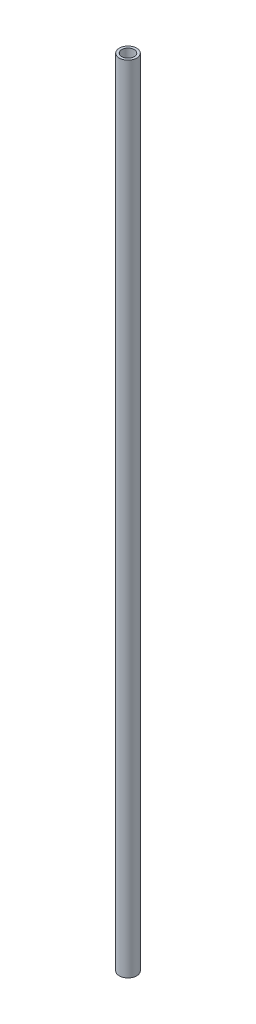
ISO-10303-21;
HEADER;
FILE_DESCRIPTION(('STEP AP214'),'2;1');
FILE_NAME('part.step','',(''),(''),'','','');
FILE_SCHEMA(('AUTOMOTIVE_DESIGN { 1 0 10303 214 1 1 1 1 }'));
ENDSEC;
DATA;
#1=APPLICATION_CONTEXT('core data for automotive mechanical design processes');
#2=APPLICATION_PROTOCOL_DEFINITION('international standard','automotive_design',2000,#1);
#3=PRODUCT_CONTEXT('',#1,'mechanical');
#4=PRODUCT('Part','Part','',(#3));
#5=PRODUCT_RELATED_PRODUCT_CATEGORY('part','',(#4));
#6=PRODUCT_DEFINITION_FORMATION('','',#4);
#7=PRODUCT_DEFINITION_CONTEXT('part definition',#1,'design');
#8=PRODUCT_DEFINITION('design','',#6,#7);
#9=PRODUCT_DEFINITION_SHAPE('','',#8);
#10=(LENGTH_UNIT() NAMED_UNIT(*) SI_UNIT(.MILLI.,.METRE.));
#11=(NAMED_UNIT(*) PLANE_ANGLE_UNIT() SI_UNIT($,.RADIAN.));
#12=(NAMED_UNIT(*) SI_UNIT($,.STERADIAN.) SOLID_ANGLE_UNIT());
#13=UNCERTAINTY_MEASURE_WITH_UNIT(LENGTH_MEASURE(1.E-05),#10,'distance_accuracy_value','');
#14=(GEOMETRIC_REPRESENTATION_CONTEXT(3) GLOBAL_UNCERTAINTY_ASSIGNED_CONTEXT((#13)) GLOBAL_UNIT_ASSIGNED_CONTEXT((#10,
#11,#12)) REPRESENTATION_CONTEXT('',''));
#15=CARTESIAN_POINT('',(0.,0.,0.));
#16=DIRECTION('',(0.,0.,1.));
#17=DIRECTION('',(1.,0.,0.));
#18=AXIS2_PLACEMENT_3D('',#15,#16,#17);
#19=CARTESIAN_POINT('',(0.,1219.2,0.));
#20=DIRECTION('',(0.,1.,0.));
#21=DIRECTION('',(0.,0.,1.));
#22=AXIS2_PLACEMENT_3D('',#19,#20,#21);
#23=PLANE('',#22);
#24=CARTESIAN_POINT('',(0.,1219.2,0.));
#25=DIRECTION('',(0.,1.,0.));
#26=DIRECTION('',(0.,0.,1.));
#27=AXIS2_PLACEMENT_3D('',#24,#25,#26);
#28=CIRCLE('',#27,13.335);
#29=CARTESIAN_POINT('',(0.,1219.2,13.335));
#30=VERTEX_POINT('',#29);
#31=EDGE_CURVE('E10',#30,#30,#28,.T.);
#32=ORIENTED_EDGE('',*,*,#31,.T.);
#33=EDGE_LOOP('',(#32));
#34=FACE_BOUND('',#33,.T.);
#35=CARTESIAN_POINT('',(0.,1219.2,0.));
#36=DIRECTION('',(0.,1.,0.));
#37=DIRECTION('',(0.,0.,1.));
#38=AXIS2_PLACEMENT_3D('',#35,#36,#37);
#39=CIRCLE('',#38,9.525);
#40=CARTESIAN_POINT('',(0.,1219.2,9.525));
#41=VERTEX_POINT('',#40);
#42=EDGE_CURVE('E45',#41,#41,#39,.T.);
#43=ORIENTED_EDGE('',*,*,#42,.F.);
#44=EDGE_LOOP('',(#43));
#45=FACE_BOUND('',#44,.T.);
#46=ADVANCED_FACE('F34',(#34,#45),#23,.T.);
#47=CARTESIAN_POINT('',(0.,0.,0.));
#48=DIRECTION('',(0.,1.,0.));
#49=DIRECTION('',(0.,0.,1.));
#50=AXIS2_PLACEMENT_3D('',#47,#48,#49);
#51=PLANE('',#50);
#52=CARTESIAN_POINT('',(0.,0.,0.));
#53=DIRECTION('',(0.,1.,0.));
#54=DIRECTION('',(0.,0.,1.));
#55=AXIS2_PLACEMENT_3D('',#52,#53,#54);
#56=CIRCLE('',#55,13.335);
#57=CARTESIAN_POINT('',(0.,0.,13.335));
#58=VERTEX_POINT('',#57);
#59=EDGE_CURVE('E38',#58,#58,#56,.T.);
#60=ORIENTED_EDGE('',*,*,#59,.F.);
#61=EDGE_LOOP('',(#60));
#62=FACE_BOUND('',#61,.T.);
#63=CARTESIAN_POINT('',(0.,0.,0.));
#64=DIRECTION('',(0.,1.,0.));
#65=DIRECTION('',(0.,0.,1.));
#66=AXIS2_PLACEMENT_3D('',#63,#64,#65);
#67=CIRCLE('',#66,9.525);
#68=CARTESIAN_POINT('',(0.,0.,9.525));
#69=VERTEX_POINT('',#68);
#70=EDGE_CURVE('E47',#69,#69,#67,.T.);
#71=ORIENTED_EDGE('',*,*,#70,.T.);
#72=EDGE_LOOP('',(#71));
#73=FACE_BOUND('',#72,.T.);
#74=ADVANCED_FACE('F57',(#62,#73),#51,.F.);
#75=CARTESIAN_POINT('',(0.,1219.2,0.));
#76=DIRECTION('',(0.,-1.,0.));
#77=DIRECTION('',(0.,0.,-1.));
#78=AXIS2_PLACEMENT_3D('',#75,#76,#77);
#79=CYLINDRICAL_SURFACE('',#78,13.335);
#80=ORIENTED_EDGE('',*,*,#31,.F.);
#81=EDGE_LOOP('',(#80));
#82=FACE_BOUND('',#81,.T.);
#83=ORIENTED_EDGE('',*,*,#59,.T.);
#84=EDGE_LOOP('',(#83));
#85=FACE_BOUND('',#84,.T.);
#86=ADVANCED_FACE('F36',(#82,#85),#79,.T.);
#87=CARTESIAN_POINT('',(0.,1219.2,0.));
#88=DIRECTION('',(0.,-1.,0.));
#89=DIRECTION('',(0.,0.,-1.));
#90=AXIS2_PLACEMENT_3D('',#87,#88,#89);
#91=CYLINDRICAL_SURFACE('',#90,9.525);
#92=ORIENTED_EDGE('',*,*,#42,.T.);
#93=EDGE_LOOP('',(#92));
#94=FACE_BOUND('',#93,.T.);
#95=ORIENTED_EDGE('',*,*,#70,.F.);
#96=EDGE_LOOP('',(#95));
#97=FACE_BOUND('',#96,.T.);
#98=ADVANCED_FACE('F53',(#94,#97),#91,.F.);
#99=CLOSED_SHELL('',(#46,#74,#86,#98));
#100=MANIFOLD_SOLID_BREP('B2',#99);
#101=ADVANCED_BREP_SHAPE_REPRESENTATION('',(#18,#100),#14);
#102=SHAPE_DEFINITION_REPRESENTATION(#9,#101);
ENDSEC;
END-ISO-10303-21;
